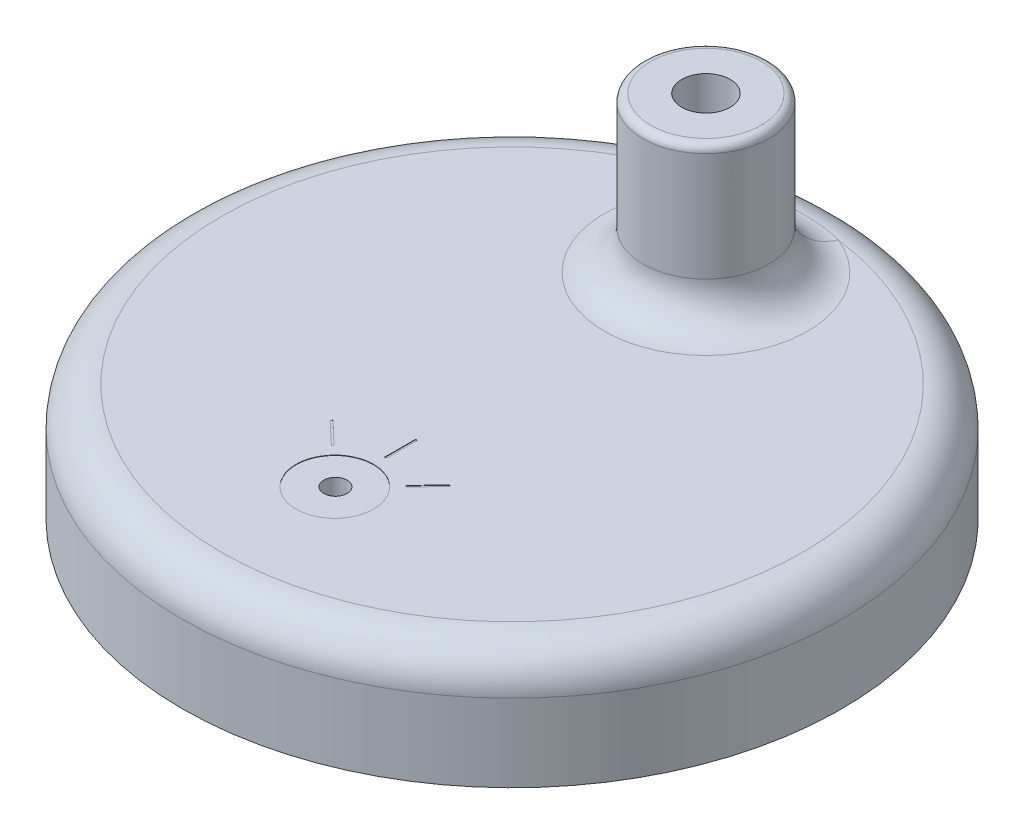
ISO-10303-21;
HEADER;
FILE_DESCRIPTION(('STEP AP214'),'2;1');
FILE_NAME('part.step','',(''),(''),'','','');
FILE_SCHEMA(('AUTOMOTIVE_DESIGN { 1 0 10303 214 1 1 1 1 }'));
ENDSEC;
DATA;
#1=APPLICATION_CONTEXT('core data for automotive mechanical design processes');
#2=APPLICATION_PROTOCOL_DEFINITION('international standard','automotive_design',2000,#1);
#3=PRODUCT_CONTEXT('',#1,'mechanical');
#4=PRODUCT('Part','Part','',(#3));
#5=PRODUCT_RELATED_PRODUCT_CATEGORY('part','',(#4));
#6=PRODUCT_DEFINITION_FORMATION('','',#4);
#7=PRODUCT_DEFINITION_CONTEXT('part definition',#1,'design');
#8=PRODUCT_DEFINITION('design','',#6,#7);
#9=PRODUCT_DEFINITION_SHAPE('','',#8);
#10=(LENGTH_UNIT() NAMED_UNIT(*) SI_UNIT(.MILLI.,.METRE.));
#11=(NAMED_UNIT(*) PLANE_ANGLE_UNIT() SI_UNIT($,.RADIAN.));
#12=(NAMED_UNIT(*) SI_UNIT($,.STERADIAN.) SOLID_ANGLE_UNIT());
#13=UNCERTAINTY_MEASURE_WITH_UNIT(LENGTH_MEASURE(1.E-05),#10,'distance_accuracy_value','');
#14=(GEOMETRIC_REPRESENTATION_CONTEXT(3) GLOBAL_UNCERTAINTY_ASSIGNED_CONTEXT((#13)) GLOBAL_UNIT_ASSIGNED_CONTEXT((#10,
#11,#12)) REPRESENTATION_CONTEXT('',''));
#15=CARTESIAN_POINT('',(0.,0.,0.));
#16=DIRECTION('',(0.,0.,1.));
#17=DIRECTION('',(1.,0.,0.));
#18=AXIS2_PLACEMENT_3D('',#15,#16,#17);
#19=CARTESIAN_POINT('',(0.,5.,0.));
#20=DIRECTION('',(0.,1.,0.));
#21=DIRECTION('',(0.,0.,1.));
#22=AXIS2_PLACEMENT_3D('',#19,#20,#21);
#23=PLANE('',#22);
#24=CARTESIAN_POINT('',(0.,5.,0.));
#25=DIRECTION('',(0.,1.,0.));
#26=DIRECTION('',(0.,0.,1.));
#27=AXIS2_PLACEMENT_3D('',#24,#25,#26);
#28=CIRCLE('',#27,77.);
#29=CARTESIAN_POINT('',(0.,5.,77.));
#30=VERTEX_POINT('',#29);
#31=EDGE_CURVE('E303',#30,#30,#28,.T.);
#32=ORIENTED_EDGE('',*,*,#31,.T.);
#33=EDGE_LOOP('',(#32));
#34=FACE_BOUND('',#33,.T.);
#35=ADVANCED_FACE('F59',(#34),#23,.T.);
#36=CARTESIAN_POINT('',(0.,22.,0.));
#37=DIRECTION('',(0.,1.,0.));
#38=DIRECTION('',(0.,0.,1.));
#39=AXIS2_PLACEMENT_3D('',#36,#37,#38);
#40=PLANE('',#39);
#41=CARTESIAN_POINT('',(0.,22.,-50.));
#42=DIRECTION('',(0.,1.,0.));
#43=DIRECTION('',(0.,0.,1.));
#44=AXIS2_PLACEMENT_3D('',#41,#42,#43);
#45=CIRCLE('',#44,6.25);
#46=CARTESIAN_POINT('',(0.,22.,-43.75));
#47=VERTEX_POINT('',#46);
#48=EDGE_CURVE('E274',#47,#47,#45,.F.);
#49=ORIENTED_EDGE('',*,*,#48,.F.);
#50=EDGE_LOOP('',(#49));
#51=FACE_BOUND('',#50,.T.);
#52=CARTESIAN_POINT('',(0.,22.,0.));
#53=DIRECTION('',(0.,1.,0.));
#54=DIRECTION('',(0.,0.,1.));
#55=AXIS2_PLACEMENT_3D('',#52,#53,#54);
#56=CIRCLE('',#55,75.);
#57=CARTESIAN_POINT('',(0.,22.,75.));
#58=VERTEX_POINT('',#57);
#59=EDGE_CURVE('E283',#58,#58,#56,.T.);
#60=ORIENTED_EDGE('',*,*,#59,.F.);
#61=EDGE_LOOP('',(#60));
#62=FACE_BOUND('',#61,.T.);
#63=ADVANCED_FACE('F363',(#51,#62),#40,.F.);
#64=CARTESIAN_POINT('',(0.,20.,0.));
#65=DIRECTION('',(0.,1.,0.));
#66=DIRECTION('',(0.,0.,1.));
#67=AXIS2_PLACEMENT_3D('',#64,#65,#66);
#68=TOROIDAL_SURFACE('',#67,75.,2.);
#69=CARTESIAN_POINT('',(0.,20.,0.));
#70=DIRECTION('',(0.,-1.,0.));
#71=DIRECTION('',(0.,0.,-1.));
#72=AXIS2_PLACEMENT_3D('',#69,#70,#71);
#73=CIRCLE('',#72,77.);
#74=CARTESIAN_POINT('',(0.,20.,-77.));
#75=VERTEX_POINT('',#74);
#76=EDGE_CURVE('E284',#75,#75,#73,.T.);
#77=ORIENTED_EDGE('',*,*,#76,.T.);
#78=EDGE_LOOP('',(#77));
#79=FACE_BOUND('',#78,.T.);
#80=ORIENTED_EDGE('',*,*,#59,.T.);
#81=EDGE_LOOP('',(#80));
#82=FACE_BOUND('',#81,.T.);
#83=ADVANCED_FACE('F368',(#79,#82),#68,.F.);
#84=CARTESIAN_POINT('',(0.,30.,0.));
#85=DIRECTION('',(0.,-1.,0.));
#86=DIRECTION('',(0.,0.,-1.));
#87=AXIS2_PLACEMENT_3D('',#84,#85,#86);
#88=CYLINDRICAL_SURFACE('',#87,77.);
#89=ORIENTED_EDGE('',*,*,#31,.F.);
#90=EDGE_LOOP('',(#89));
#91=FACE_BOUND('',#90,.T.);
#92=ORIENTED_EDGE('',*,*,#76,.F.);
#93=EDGE_LOOP('',(#92));
#94=FACE_BOUND('',#93,.T.);
#95=ADVANCED_FACE('F372',(#91,#94),#88,.F.);
#96=CARTESIAN_POINT('',(0.,30.,0.));
#97=DIRECTION('',(0.,-1.,0.));
#98=DIRECTION('',(0.,0.,-1.));
#99=AXIS2_PLACEMENT_3D('',#96,#97,#98);
#100=CYLINDRICAL_SURFACE('',#99,85.);
#101=CARTESIAN_POINT('',(0.,20.,0.));
#102=DIRECTION('',(0.,1.,0.));
#103=DIRECTION('',(0.,0.,1.));
#104=AXIS2_PLACEMENT_3D('',#101,#102,#103);
#105=CIRCLE('',#104,85.);
#106=CARTESIAN_POINT('',(0.,20.,85.));
#107=VERTEX_POINT('',#106);
#108=EDGE_CURVE('E299',#107,#107,#105,.F.);
#109=ORIENTED_EDGE('',*,*,#108,.T.);
#110=EDGE_LOOP('',(#109));
#111=FACE_BOUND('',#110,.T.);
#112=CARTESIAN_POINT('',(0.,0.,0.));
#113=DIRECTION('',(0.,1.,0.));
#114=DIRECTION('',(0.,0.,1.));
#115=AXIS2_PLACEMENT_3D('',#112,#113,#114);
#116=CIRCLE('',#115,85.);
#117=CARTESIAN_POINT('',(0.,0.,85.));
#118=VERTEX_POINT('',#117);
#119=EDGE_CURVE('E288',#118,#118,#116,.T.);
#120=ORIENTED_EDGE('',*,*,#119,.T.);
#121=EDGE_LOOP('',(#120));
#122=FACE_BOUND('',#121,.T.);
#123=ADVANCED_FACE('F374',(#111,#122),#100,.T.);
#124=CARTESIAN_POINT('',(0.,30.,0.));
#125=DIRECTION('',(0.,1.,0.));
#126=DIRECTION('',(0.,0.,1.));
#127=AXIS2_PLACEMENT_3D('',#124,#125,#126);
#128=PLANE('',#127);
#129=DIRECTION('',(-0.727050121833967,0.,-0.686584386904635));
#130=VECTOR('',#129,1.);
#131=CARTESIAN_POINT('',(-15.0964064617871,30.,31.1184412613822));
#132=LINE('',#131,#130);
#133=CARTESIAN_POINT('',(-9.2800054871154,30.,36.6111163566193));
#134=VERTEX_POINT('',#133);
#135=CARTESIAN_POINT('',(-15.0964064617871,30.,31.1184412613822));
#136=VERTEX_POINT('',#135);
#137=EDGE_CURVE('E76',#134,#136,#132,.T.);
#138=ORIENTED_EDGE('',*,*,#137,.F.);
#139=DIRECTION('',(0.686584386904637,0.,-0.727050121833966));
#140=VECTOR('',#139,1.);
#141=CARTESIAN_POINT('',(-9.2800054871154,30.,36.6111163566193));
#142=LINE('',#141,#140);
#143=CARTESIAN_POINT('',(-9.62329768056772,30.,36.9746414175363));
#144=VERTEX_POINT('',#143);
#145=EDGE_CURVE('E240',#144,#134,#142,.T.);
#146=ORIENTED_EDGE('',*,*,#145,.F.);
#147=DIRECTION('',(0.727050121833967,0.,0.686584386904635));
#148=VECTOR('',#147,1.);
#149=CARTESIAN_POINT('',(-9.62329768056772,30.,36.9746414175363));
#150=LINE('',#149,#148);
#151=CARTESIAN_POINT('',(-15.4396986552395,30.,31.4819663222992));
#152=VERTEX_POINT('',#151);
#153=EDGE_CURVE('E254',#152,#144,#150,.T.);
#154=ORIENTED_EDGE('',*,*,#153,.F.);
#155=DIRECTION('',(-0.686584386904628,0.,0.727050121833974));
#156=VECTOR('',#155,1.);
#157=CARTESIAN_POINT('',(-15.4396986552395,30.,31.4819663222992));
#158=LINE('',#157,#156);
#159=EDGE_CURVE('E251',#136,#152,#158,.T.);
#160=ORIENTED_EDGE('',*,*,#159,.F.);
#161=EDGE_LOOP('',(#138,#146,#154,#160));
#162=FACE_BOUND('',#161,.T.);
#163=DIRECTION('',(-0.686584386904635,0.,0.727050121833967));
#164=VECTOR('',#163,1.);
#165=CARTESIAN_POINT('',(14.4218951487858,30.,30.4538447339518));
#166=LINE('',#165,#164);
#167=CARTESIAN_POINT('',(14.4218951487858,30.,30.4538447339518));
#168=VERTEX_POINT('',#167);
#169=CARTESIAN_POINT('',(8.9292200535487,30.,36.2702457086236));
#170=VERTEX_POINT('',#169);
#171=EDGE_CURVE('E84',#168,#170,#166,.T.);
#172=ORIENTED_EDGE('',*,*,#171,.F.);
#173=DIRECTION('',(-0.727050121833964,0.,-0.686584386904638));
#174=VECTOR('',#173,1.);
#175=CARTESIAN_POINT('',(14.7854202097028,30.,30.7971369274041));
#176=LINE('',#175,#174);
#177=CARTESIAN_POINT('',(14.7854202097028,30.,30.7971369274041));
#178=VERTEX_POINT('',#177);
#179=EDGE_CURVE('E210',#178,#168,#176,.T.);
#180=ORIENTED_EDGE('',*,*,#179,.F.);
#181=DIRECTION('',(0.686584386904635,0.,-0.727050121833967));
#182=VECTOR('',#181,1.);
#183=CARTESIAN_POINT('',(9.29274511446568,30.,36.6135379020759));
#184=LINE('',#183,#182);
#185=CARTESIAN_POINT('',(9.29274511446568,30.,36.6135379020759));
#186=VERTEX_POINT('',#185);
#187=EDGE_CURVE('E225',#186,#178,#184,.T.);
#188=ORIENTED_EDGE('',*,*,#187,.F.);
#189=DIRECTION('',(0.727050121833966,0.,0.686584386904637));
#190=VECTOR('',#189,1.);
#191=CARTESIAN_POINT('',(8.9292200535487,30.,36.2702457086236));
#192=LINE('',#191,#190);
#193=EDGE_CURVE('E221',#170,#186,#192,.T.);
#194=ORIENTED_EDGE('',*,*,#193,.F.);
#195=EDGE_LOOP('',(#172,#180,#188,#194));
#196=FACE_BOUND('',#195,.T.);
#197=DIRECTION('',(0.,0.,1.));
#198=VECTOR('',#197,1.);
#199=CARTESIAN_POINT('',(-0.169896060632773,30.,24.718475916838));
#200=LINE('',#199,#198);
#201=CARTESIAN_POINT('',(-0.169896060632773,30.,24.718475916838));
#202=VERTEX_POINT('',#201);
#203=CARTESIAN_POINT('',(-0.169896060632772,30.,32.718475916838));
#204=VERTEX_POINT('',#203);
#205=EDGE_CURVE('E169',#202,#204,#200,.T.);
#206=ORIENTED_EDGE('',*,*,#205,.F.);
#207=DIRECTION('',(-1.,0.,0.));
#208=VECTOR('',#207,1.);
#209=CARTESIAN_POINT('',(0.330103939367228,30.,24.718475916838));
#210=LINE('',#209,#208);
#211=CARTESIAN_POINT('',(0.330103939367228,30.,24.718475916838));
#212=VERTEX_POINT('',#211);
#213=EDGE_CURVE('E186',#212,#202,#210,.T.);
#214=ORIENTED_EDGE('',*,*,#213,.F.);
#215=DIRECTION('',(0.,0.,-1.));
#216=VECTOR('',#215,1.);
#217=CARTESIAN_POINT('',(0.330103939367228,30.,32.718475916838));
#218=LINE('',#217,#216);
#219=CARTESIAN_POINT('',(0.330103939367228,30.,32.718475916838));
#220=VERTEX_POINT('',#219);
#221=EDGE_CURVE('E189',#220,#212,#218,.T.);
#222=ORIENTED_EDGE('',*,*,#221,.F.);
#223=DIRECTION('',(1.,0.,0.));
#224=VECTOR('',#223,1.);
#225=CARTESIAN_POINT('',(-0.169896060632772,30.,32.718475916838));
#226=LINE('',#225,#224);
#227=EDGE_CURVE('E195',#204,#220,#226,.T.);
#228=ORIENTED_EDGE('',*,*,#227,.F.);
#229=EDGE_LOOP('',(#206,#214,#222,#228));
#230=FACE_BOUND('',#229,.T.);
#231=CARTESIAN_POINT('',(0.,30.,45.718475916838));
#232=DIRECTION('',(0.,1.,0.));
#233=DIRECTION('',(0.,0.,1.));
#234=AXIS2_PLACEMENT_3D('',#231,#232,#233);
#235=CIRCLE('',#234,10.);
#236=CARTESIAN_POINT('',(0.,30.,55.718475916838));
#237=VERTEX_POINT('',#236);
#238=EDGE_CURVE('E202',#237,#237,#235,.T.);
#239=ORIENTED_EDGE('',*,*,#238,.F.);
#240=EDGE_LOOP('',(#239));
#241=FACE_BOUND('',#240,.T.);
#242=CARTESIAN_POINT('',(0.,30.,0.));
#243=DIRECTION('',(0.,1.,0.));
#244=DIRECTION('',(0.,0.,1.));
#245=AXIS2_PLACEMENT_3D('',#242,#243,#244);
#246=CIRCLE('',#245,75.);
#247=CARTESIAN_POINT('',(-9.78178662665336,30.,-74.359375));
#248=VERTEX_POINT('',#247);
#249=CARTESIAN_POINT('',(9.78178662665336,30.,-74.359375));
#250=VERTEX_POINT('',#249);
#251=EDGE_CURVE('E295',#248,#250,#246,.T.);
#252=ORIENTED_EDGE('',*,*,#251,.T.);
#253=CARTESIAN_POINT('',(0.,30.,-50.));
#254=DIRECTION('',(0.,1.,0.));
#255=DIRECTION('',(0.,0.,1.));
#256=AXIS2_PLACEMENT_3D('',#253,#254,#255);
#257=CIRCLE('',#256,26.25);
#258=EDGE_CURVE('E320',#250,#248,#257,.F.);
#259=ORIENTED_EDGE('',*,*,#258,.T.);
#260=EDGE_LOOP('',(#252,#259));
#261=FACE_BOUND('',#260,.T.);
#262=ADVANCED_FACE('F380',(#162,#196,#230,#241,#261),#128,.T.);
#263=CARTESIAN_POINT('',(0.,0.,0.));
#264=DIRECTION('',(0.,1.,0.));
#265=DIRECTION('',(0.,0.,1.));
#266=AXIS2_PLACEMENT_3D('',#263,#264,#265);
#267=PLANE('',#266);
#268=ORIENTED_EDGE('',*,*,#119,.F.);
#269=EDGE_LOOP('',(#268));
#270=FACE_BOUND('',#269,.T.);
#271=ADVANCED_FACE('F383',(#270),#267,.F.);
#272=CARTESIAN_POINT('',(0.,20.,0.));
#273=DIRECTION('',(0.,1.,0.));
#274=DIRECTION('',(0.,0.,1.));
#275=AXIS2_PLACEMENT_3D('',#272,#273,#274);
#276=TOROIDAL_SURFACE('',#275,75.,10.);
#277=ORIENTED_EDGE('',*,*,#108,.F.);
#278=EDGE_LOOP('',(#277));
#279=FACE_BOUND('',#278,.T.);
#280=ORIENTED_EDGE('',*,*,#251,.F.);
#281=CARTESIAN_POINT('',(10.5892808352099,39.7696777139004,-62.3259738517107));
#282=CARTESIAN_POINT('',(9.9886021369751,28.3430177597039,-62.8420187098177));
#283=CARTESIAN_POINT('',(17.4654145650734,29.8848388569502,-71.3810900013605));
#284=CARTESIAN_POINT('',(10.4211580877375,39.7944853348349,-62.4704101996094));
#285=CARTESIAN_POINT('',(9.86158526746597,28.440254038051,-62.9369728356673));
#286=CARTESIAN_POINT('',(17.1680491111589,29.8972426683596,-71.5372842108471));
#287=CARTESIAN_POINT('',(10.2500144982206,39.8166002484764,-62.6114591233314));
#288=CARTESIAN_POINT('',(9.72918364786473,28.5340887629314,-63.0338780773345));
#289=CARTESIAN_POINT('',(16.8673336116823,29.9083001248585,-71.6898246945153));
#290=CARTESIAN_POINT('',(9.90197769192208,39.8560771535765,-62.8865253218822));
#291=CARTESIAN_POINT('',(9.4547061713332,28.7141812497531,-63.2293112709063));
#292=CARTESIAN_POINT('',(16.2595496195871,29.9280385761398,-71.9873137794136));
#293=CARTESIAN_POINT('',(9.72508478635956,39.8734394018263,-63.020542976301));
#294=CARTESIAN_POINT('',(9.31266120479179,28.800519937613,-63.3278554946196));
#295=CARTESIAN_POINT('',(15.9524814711727,29.9367196993178,-72.1322627904758));
#296=CARTESIAN_POINT('',(9.18642567546236,39.9193294419931,-63.4115174197748));
#297=CARTESIAN_POINT('',(8.87391098920631,29.0474277683155,-63.6226075006375));
#298=CARTESIAN_POINT('',(15.0226226163759,29.9596647184769,-72.5551376061283));
#299=CARTESIAN_POINT('',(8.81645998557508,39.9416910991291,-63.6575839183294));
#300=CARTESIAN_POINT('',(8.56151509470498,29.1981677130123,-63.8202677293131));
#301=CARTESIAN_POINT('',(14.3907904295281,29.9708455489803,-72.8212947627694));
#302=CARTESIAN_POINT('',(8.05733913474006,39.9744653829228,-64.1187531938297));
#303=CARTESIAN_POINT('',(7.90158022411722,29.4715296361413,-64.2056613042062));
#304=CARTESIAN_POINT('',(13.1062053866122,29.987232692046,-73.3201157707678));
#305=CARTESIAN_POINT('',(7.66817445552697,39.9848720192834,-64.333840400828));
#306=CARTESIAN_POINT('',(7.55396358322567,29.5946751616791,-64.3937906175611));
#307=CARTESIAN_POINT('',(12.4534422108957,29.9924360094583,-73.5527627801927));
#308=CARTESIAN_POINT('',(6.87341746592075,39.9976385590885,-64.731467173759));
#309=CARTESIAN_POINT('',(6.8277897650402,29.8153144752179,-64.7515145130012));
#310=CARTESIAN_POINT('',(11.1301663955538,29.998819278999,-73.9828388991872));
#311=CARTESIAN_POINT('',(6.4678215371667,39.9999966802982,-64.913999522379));
#312=CARTESIAN_POINT('',(6.44896810470131,29.9132427754762,-64.92158064195));
#313=CARTESIAN_POINT('',(10.4596498578083,29.9999983400104,-74.1802601993289));
#314=CARTESIAN_POINT('',(5.56427199785282,40.0000039530872,-65.2768250546034));
#315=CARTESIAN_POINT('',(5.59113448684195,30.1023376168339,-65.266025981781));
#316=CARTESIAN_POINT('',(8.97458988734105,30.0000019767088,-74.572664165748));
#317=CARTESIAN_POINT('',(5.06346185789517,39.9966688098448,-65.4500462776576));
#318=CARTESIAN_POINT('',(5.10527472500088,30.1893644260811,-65.4361211757409));
#319=CARTESIAN_POINT('',(8.15697557486438,29.9983344048733,-74.7599948101594));
#320=CARTESIAN_POINT('',(4.04729196626958,39.9878346222389,-65.7468151794958));
#321=CARTESIAN_POINT('',(4.10581077644026,30.3345588946786,-65.7314261869672));
#322=CARTESIAN_POINT('',(6.50618114487869,29.9939173109966,-75.0809207248028));
#323=CARTESIAN_POINT('',(3.53193004739577,39.9823352539613,-65.8703554170522));
#324=CARTESIAN_POINT('',(3.59115645469042,30.3931255296197,-65.8573439947149));
#325=CARTESIAN_POINT('',(5.67299871511673,29.9911676269985,-75.2145079453355));
#326=CARTESIAN_POINT('',(2.49173311588022,39.9724022952317,-66.0665430253609));
#327=CARTESIAN_POINT('',(2.54406305972268,30.4845068126704,-66.0585043677846));
#328=CARTESIAN_POINT('',(3.99660379540629,29.986201147598,-75.4266434416885));
#329=CARTESIAN_POINT('',(1.96690052384671,39.9679684364809,-66.1392032167229));
#330=CARTESIAN_POINT('',(2.01036068094542,30.5175761367642,-66.1342757511084));
#331=CARTESIAN_POINT('',(3.15339388665316,29.9839842180464,-75.5052055825733));
#332=CARTESIAN_POINT('',(0.912684734294976,39.9620820885479,-66.2329760232595));
#333=CARTESIAN_POINT('',(0.93518608682164,30.5599493978722,-66.2320334947921));
#334=CARTESIAN_POINT('',(1.46214948603906,29.9810410440743,-75.6065941690375));
#335=CARTESIAN_POINT('',(0.383301959205837,39.9606293255462,-66.2540933727794));
#336=CARTESIAN_POINT('',(0.392312085277312,30.5693687496259,-66.2542835165303));
#337=CARTESIAN_POINT('',(0.614115444460004,29.980314662744,-75.6294257336168));
#338=CARTESIAN_POINT('',(-0.650778233775684,39.96124169905,-66.2448148930502));
#339=CARTESIAN_POINT('',(-0.666261042870669,30.5652117957447,-66.2445716301269));
#340=CARTESIAN_POINT('',(-1.0426524617699,29.9806208495527,-75.6193938925324));
#341=CARTESIAN_POINT('',(-1.15549790844854,39.963149065443,-66.2167296427287));
#342=CARTESIAN_POINT('',(-1.18335655466072,30.552657500389,-66.2150191120665));
#343=CARTESIAN_POINT('',(-1.85141082533483,29.981574532648,-75.5890286365732));
#344=CARTESIAN_POINT('',(-2.16013153070465,39.9694984398459,-66.1136987711106));
#345=CARTESIAN_POINT('',(-2.20669743340486,30.5059643225316,-66.107773687427));
#346=CARTESIAN_POINT('',(-3.46381225422689,29.9847492198367,-75.4776293480798));
#347=CARTESIAN_POINT('',(-2.66004549913757,39.9739404368543,-66.0387533532112));
#348=CARTESIAN_POINT('',(-2.71415008318575,30.471711719513,-66.0298233979263));
#349=CARTESIAN_POINT('',(-4.26745534174164,29.9869702184294,-75.3965955354733));
#350=CARTESIAN_POINT('',(-3.65070950947554,39.9835634697533,-65.8426577074798));
#351=CARTESIAN_POINT('',(-3.70969036604063,30.3800265906688,-65.8291939751761));
#352=CARTESIAN_POINT('',(-5.86496329822207,29.9917817348745,-75.1845577226091));
#353=CARTESIAN_POINT('',(-4.14145968359005,39.9887444949723,-65.721508146793));
#354=CARTESIAN_POINT('',(-4.19886516470898,30.3223672331113,-65.7060489053849));
#355=CARTESIAN_POINT('',(-6.65882830820335,29.9943722473911,-75.0535544438646));
#356=CARTESIAN_POINT('',(-5.1095380474594,39.9969639871098,-65.4340538123098));
#357=CARTESIAN_POINT('',(-5.14976671165493,30.181357542519,-65.4205107392177));
#358=CARTESIAN_POINT('',(-8.23220956670001,29.9984819935525,-74.7426997114601));
#359=CARTESIAN_POINT('',(-5.58686733910364,40.0000026304194,-65.2677527575858));
#360=CARTESIAN_POINT('',(-5.61239235809538,30.0976527581988,-65.2574948252393));
#361=CARTESIAN_POINT('',(-9.01172699136383,30.0000013153929,-74.5628522810316));
#362=CARTESIAN_POINT('',(-6.46769357502888,39.9999976852287,-64.9140500327656));
#363=CARTESIAN_POINT('',(-6.44884309246948,29.9132693750597,-64.9216268397239));
#364=CARTESIAN_POINT('',(-10.459439758981,29.9999988424532,-74.1803148200741));
#365=CARTESIAN_POINT('',(-6.87317689374355,39.9976402035407,-64.7315751199425));
#366=CARTESIAN_POINT('',(-6.82756333866053,29.815372669955,-64.7516150156731));
#367=CARTESIAN_POINT('',(-11.129768765096,29.9988201011625,-73.9829556485599));
#368=CARTESIAN_POINT('',(-7.66773014937943,39.9848813754319,-64.3340750941808));
#369=CARTESIAN_POINT('',(-7.55356211273921,29.5948078423041,-64.3939995263515));
#370=CARTESIAN_POINT('',(-12.4526995175216,29.9924406875043,-73.5530166322736));
#371=CARTESIAN_POINT('',(-8.05680299827093,39.9744814624936,-64.1190557874461));
#372=CARTESIAN_POINT('',(-7.90110335569886,29.4717045692311,-64.205923996524));
#373=CARTESIAN_POINT('',(-13.105304401524,29.9872407318779,-73.3204430700534));
#374=CARTESIAN_POINT('',(-8.81595946082969,39.9417197642112,-63.6579110554723));
#375=CARTESIAN_POINT('',(-8.56109085046999,29.1983662585109,-63.8205314376144));
#376=CARTESIAN_POINT('',(-14.3899371888429,29.9708598814745,-72.8216486077874));
#377=CARTESIAN_POINT('',(-9.18604225792847,39.9193574649585,-63.411784294192));
#378=CARTESIAN_POINT('',(-8.87359367568541,29.0475935362568,-63.62281438197));
#379=CARTESIAN_POINT('',(-15.0219642068888,29.9596787297432,-72.5554262625525));
#380=CARTESIAN_POINT('',(-9.72486040969173,39.8734608352862,-63.0207115470778));
#381=CARTESIAN_POINT('',(-9.3124806539977,28.8006280207715,-63.3279799780949));
#382=CARTESIAN_POINT('',(-15.9520924089999,29.9367304159106,-72.1324451117974));
#383=CARTESIAN_POINT('',(-9.90180027245325,39.8560959115145,-62.8866626298353));
#384=CARTESIAN_POINT('',(-9.45456522794619,28.7142702620476,-63.2294103336201));
#385=CARTESIAN_POINT('',(-16.2592407170763,29.9280479550537,-71.9874622837401));
#386=CARTESIAN_POINT('',(-10.2499280000546,39.8166114231398,-62.6115303969441));
#387=CARTESIAN_POINT('',(-9.72911697095465,28.5341360060561,-63.033926856606));
#388=CARTESIAN_POINT('',(-16.8671816297355,29.9083057122449,-71.6899017750215));
#389=CARTESIAN_POINT('',(-10.4211155587688,39.7944916059532,-62.4704467079088));
#390=CARTESIAN_POINT('',(-9.86155323903102,28.4402785285155,-62.9369967339161));
#391=CARTESIAN_POINT('',(-17.1679738957479,29.8972458040011,-71.5373236912255));
#392=CARTESIAN_POINT('',(-10.5892808352099,39.7696777139004,-62.3259738517107));
#393=CARTESIAN_POINT('',(-9.98860213697511,28.3430177597039,-62.8420187098177));
#394=CARTESIAN_POINT('',(-17.4654145650734,29.8848388569502,-71.3810900013604));
#395=(BOUNDED_SURFACE() B_SPLINE_SURFACE(3,2,((#281,#282,#283),(#284,#285,#286),(#287,#288,
#289),(#290,#291,#292),(#293,#294,#295),(#296,#297,#298),(#299,#300,#301),(#302,#303,#304),
(#305,#306,#307),(#308,#309,#310),(#311,#312,#313),(#314,#315,#316),(#317,#318,#319),(#320,#321,
#322),(#323,#324,#325),(#326,#327,#328),(#329,#330,#331),(#332,#333,#334),(#335,#336,#337),
(#338,#339,#340),(#341,#342,#343),(#344,#345,#346),(#347,#348,#349),(#350,#351,#352),(#353,#354,
#355),(#356,#357,#358),(#359,#360,#361),(#362,#363,#364),(#365,#366,#367),(#368,#369,#370),
(#371,#372,#373),(#374,#375,#376),(#377,#378,#379),(#380,#381,#382),(#383,#384,#385),(#386,#387,
#388),(#389,#390,#391),(#392,#393,#394)),.UNSPECIFIED.,.F.,.F.,
.F.) B_SPLINE_SURFACE_WITH_KNOTS((4,2,2,2,2,2,2,2,2,2,2,2,2,2,2,2,2,2,4),(3,3),(0.,
1.07652589818409,2.15299361915025,4.30453091176525,6.45714580468083,8.61023733413072,
11.1741298453853,13.7384062340593,16.3020362509166,18.8654307827662,21.311650782306,
23.7578601640707,26.204034226159,28.6500068610301,30.8024648547347,32.9545392828233,
35.1067061722739,36.1834467469312,37.2602445329957),(0.,1.),
.UNSPECIFIED.) GEOMETRIC_REPRESENTATION_ITEM() RATIONAL_B_SPLINE_SURFACE(((1.,0.657673203835904,
1.),(1.,0.660180589968664,1.),(1.,0.662645040851511,1.),(1.,0.667477348452048,1.),(1.,
0.669845210382648,1.),(1.,0.676785223437298,1.),(1.,0.681197085734754,1.),(1.,0.689520685332682,
1.),(1.,0.693432171038161,1.),(1.,0.700698276543464,1.),(1.,0.70405277284909,1.),(1.,
0.710743481716281,1.),(1.,0.713954091865075,1.),(1.,0.719468334504517,1.),(1.,0.721771831126451,
1.),(1.,0.72543477550373,1.),(1.,0.72679446107715,1.),(1.,0.728549861399695,1.),(1.,
0.72894566468393,1.),(1.,0.728771856792744,1.),(1.,0.728245548360262,1.),(1.,0.72631730912763,
1.),(1.,0.724915382128113,1.),(1.,0.721255423161064,1.),(1.,0.718997403554723,1.),(1.,
0.713657754643879,1.),(1.,0.710576193173821,1.),(1.,0.704053695694503,1.),(1.,0.700700258182836,
1.),(1.,0.693436450670378,1.),(1.,0.689526180020825,1.),(1.,0.681202956978801,1.),(1.,
0.676789982996413,1.),(1.,0.669848191465044,1.),(1.,0.667479767472152,1.),(1.,0.662646286191779,
1.),(1.,0.660181223776482,1.),(1.,0.657673203835905,1.))) REPRESENTATION_ITEM('') SURFACE());
#396=CARTESIAN_POINT('',(-17.4654145650734,29.8848388569502,-71.3810900013604));
#397=CARTESIAN_POINT('',(-17.1679738957479,29.8972458040011,-71.5373236912255));
#398=CARTESIAN_POINT('',(-16.8671816297355,29.9083057122449,-71.6899017750215));
#399=CARTESIAN_POINT('',(-16.2592407170763,29.9280479550537,-71.9874622837401));
#400=CARTESIAN_POINT('',(-15.9520924089999,29.9367304159106,-72.1324451117974));
#401=CARTESIAN_POINT('',(-15.0219642068888,29.9596787297432,-72.5554262625525));
#402=CARTESIAN_POINT('',(-14.3899371888429,29.9708598814745,-72.8216486077874));
#403=CARTESIAN_POINT('',(-13.105304401524,29.9872407318779,-73.3204430700534));
#404=CARTESIAN_POINT('',(-12.4526995175216,29.9924406875043,-73.5530166322736));
#405=CARTESIAN_POINT('',(-11.129768765096,29.9988201011625,-73.9829556485599));
#406=CARTESIAN_POINT('',(-10.459439758981,29.9999988424532,-74.1803148200742));
#407=CARTESIAN_POINT('',(-9.01172699136383,30.0000013153929,-74.5628522810316));
#408=CARTESIAN_POINT('',(-8.23220956670001,29.9984819935525,-74.7426997114601));
#409=CARTESIAN_POINT('',(-6.65882830820335,29.9943722473911,-75.0535544438646));
#410=CARTESIAN_POINT('',(-5.86496329822206,29.9917817348745,-75.1845577226091));
#411=CARTESIAN_POINT('',(-4.26745534174164,29.9869702184294,-75.3965955354733));
#412=CARTESIAN_POINT('',(-3.46381225422689,29.9847492198367,-75.4776293480798));
#413=CARTESIAN_POINT('',(-1.85141082533483,29.981574532648,-75.5890286365732));
#414=CARTESIAN_POINT('',(-1.0426524617699,29.9806208495527,-75.6193938925324));
#415=CARTESIAN_POINT('',(0.614115444460003,29.980314662744,-75.6294257336168));
#416=CARTESIAN_POINT('',(1.46214948603906,29.9810410440743,-75.6065941690375));
#417=CARTESIAN_POINT('',(3.15339388665316,29.9839842180464,-75.5052055825733));
#418=CARTESIAN_POINT('',(3.99660379540629,29.986201147598,-75.4266434416885));
#419=CARTESIAN_POINT('',(5.67299871511673,29.9911676269985,-75.2145079453355));
#420=CARTESIAN_POINT('',(6.50618114487869,29.9939173109966,-75.0809207248028));
#421=CARTESIAN_POINT('',(8.15697557486438,29.9983344048733,-74.7599948101594));
#422=CARTESIAN_POINT('',(8.97458988734105,30.0000019767088,-74.572664165748));
#423=CARTESIAN_POINT('',(10.4596498578083,29.9999983400104,-74.1802601993289));
#424=CARTESIAN_POINT('',(11.1301663955538,29.998819278999,-73.9828388991872));
#425=CARTESIAN_POINT('',(12.4534422108957,29.9924360094583,-73.5527627801927));
#426=CARTESIAN_POINT('',(13.1062053866122,29.987232692046,-73.3201157707678));
#427=CARTESIAN_POINT('',(14.3907904295281,29.9708455489803,-72.8212947627694));
#428=CARTESIAN_POINT('',(15.0226226163759,29.9596647184769,-72.5551376061283));
#429=CARTESIAN_POINT('',(15.9524814711727,29.9367196993178,-72.1322627904758));
#430=CARTESIAN_POINT('',(16.2595496195871,29.9280385761398,-71.9873137794136));
#431=CARTESIAN_POINT('',(16.8673336116823,29.9083001248585,-71.6898246945153));
#432=CARTESIAN_POINT('',(17.1680491111589,29.8972426683596,-71.5372842108471));
#433=CARTESIAN_POINT('',(17.4654145650734,29.8848388569502,-71.3810900013605));
#434=B_SPLINE_CURVE_WITH_KNOTS('',3,(#396,#397,#398,#399,#400,#401,#402,#403,#404,#405,#406,
#407,#408,#409,#410,#411,#412,#413,#414,#415,#416,#417,#418,#419,#420,#421,#422,#423,#424,#425,
#426,#427,#428,#429,#430,#431,#432,#433),.UNSPECIFIED.,.F.,.F.,(4,2,2,2,2,2,2,2,2,2,2,2,2,2,2,2,
2,2,4),(0.,1.07679778606445,2.15353836072181,4.30570525017241,6.45777967826098,8.61023767196558,
11.0562103068367,13.502384368925,15.9485937506897,18.3948137502295,20.9582082820791,
23.5218382989363,26.0861146876104,28.650007198865,30.8030987283149,32.9557136212304,
35.1072509138454,36.1837186348116,37.2602445329957),.UNSPECIFIED.);
#435=EDGE_CURVE('E401',#248,#250,#434,.T.);
#436=ORIENTED_EDGE('',*,*,#435,.T.);
#437=EDGE_LOOP('',(#280,#436));
#438=FACE_BOUND('',#437,.T.);
#439=ADVANCED_FACE('F330',(#279,#438),#276,.T.);
#440=CARTESIAN_POINT('',(0.,70.,-50.));
#441=DIRECTION('',(0.,1.,0.));
#442=DIRECTION('',(0.,0.,1.));
#443=AXIS2_PLACEMENT_3D('',#440,#441,#442);
#444=PLANE('',#443);
#445=CARTESIAN_POINT('',(0.,70.,-50.));
#446=DIRECTION('',(0.,1.,0.));
#447=DIRECTION('',(0.,0.,1.));
#448=AXIS2_PLACEMENT_3D('',#445,#446,#447);
#449=CIRCLE('',#448,14.25);
#450=CARTESIAN_POINT('',(0.,70.,-35.75));
#451=VERTEX_POINT('',#450);
#452=EDGE_CURVE('E69',#451,#451,#449,.T.);
#453=ORIENTED_EDGE('',*,*,#452,.T.);
#454=EDGE_LOOP('',(#453));
#455=FACE_BOUND('',#454,.T.);
#456=CARTESIAN_POINT('',(0.,70.,-50.));
#457=DIRECTION('',(0.,1.,0.));
#458=DIRECTION('',(0.,0.,1.));
#459=AXIS2_PLACEMENT_3D('',#456,#457,#458);
#460=CIRCLE('',#459,6.25);
#461=CARTESIAN_POINT('',(0.,70.,-43.75));
#462=VERTEX_POINT('',#461);
#463=EDGE_CURVE('E278',#462,#462,#460,.T.);
#464=ORIENTED_EDGE('',*,*,#463,.F.);
#465=EDGE_LOOP('',(#464));
#466=FACE_BOUND('',#465,.T.);
#467=ADVANCED_FACE('F397',(#455,#466),#444,.T.);
#468=CARTESIAN_POINT('',(0.,70.,-50.));
#469=DIRECTION('',(0.,-1.,0.));
#470=DIRECTION('',(0.,0.,-1.));
#471=AXIS2_PLACEMENT_3D('',#468,#469,#470);
#472=CYLINDRICAL_SURFACE('',#471,16.25);
#473=CARTESIAN_POINT('',(0.,68.,-50.));
#474=DIRECTION('',(0.,1.,0.));
#475=DIRECTION('',(0.,0.,1.));
#476=AXIS2_PLACEMENT_3D('',#473,#474,#475);
#477=CIRCLE('',#476,16.25);
#478=CARTESIAN_POINT('',(0.,68.,-33.75));
#479=VERTEX_POINT('',#478);
#480=EDGE_CURVE('E13',#479,#479,#477,.F.);
#481=ORIENTED_EDGE('',*,*,#480,.T.);
#482=EDGE_LOOP('',(#481));
#483=FACE_BOUND('',#482,.T.);
#484=CARTESIAN_POINT('',(0.,40.,-50.));
#485=DIRECTION('',(0.,1.,0.));
#486=DIRECTION('',(0.,0.,1.));
#487=AXIS2_PLACEMENT_3D('',#484,#485,#486);
#488=CIRCLE('',#487,16.25);
#489=CARTESIAN_POINT('',(-6.0553917212616,40.,-65.0796130952381));
#490=VERTEX_POINT('',#489);
#491=CARTESIAN_POINT('',(6.0553917212616,40.,-65.0796130952381));
#492=VERTEX_POINT('',#491);
#493=EDGE_CURVE('E307',#490,#492,#488,.T.);
#494=ORIENTED_EDGE('',*,*,#493,.T.);
#495=CARTESIAN_POINT('',(10.5892808352099,39.7696777139004,-62.3259738517107));
#496=CARTESIAN_POINT('',(10.4211580877375,39.7944853348349,-62.4704101996094));
#497=CARTESIAN_POINT('',(10.2500144982206,39.8166002484764,-62.6114591233314));
#498=CARTESIAN_POINT('',(9.90197769192208,39.8560771535765,-62.8865253218822));
#499=CARTESIAN_POINT('',(9.72508478635956,39.8734394018263,-63.020542976301));
#500=CARTESIAN_POINT('',(9.18642567546235,39.9193294419931,-63.4115174197748));
#501=CARTESIAN_POINT('',(8.81645998557508,39.9416910991291,-63.6575839183294));
#502=CARTESIAN_POINT('',(8.05733913474006,39.9744653829228,-64.1187531938297));
#503=CARTESIAN_POINT('',(7.66817445552697,39.9848720192834,-64.333840400828));
#504=CARTESIAN_POINT('',(6.87341746592075,39.9976385590885,-64.731467173759));
#505=CARTESIAN_POINT('',(6.4678215371667,39.9999966802982,-64.913999522379));
#506=CARTESIAN_POINT('',(5.56427199785283,40.0000039530872,-65.2768250546034));
#507=CARTESIAN_POINT('',(5.06346185789517,39.9966688098448,-65.4500462776576));
#508=CARTESIAN_POINT('',(4.04729196626958,39.9878346222389,-65.7468151794958));
#509=CARTESIAN_POINT('',(3.53193004739577,39.9823352539612,-65.8703554170522));
#510=CARTESIAN_POINT('',(2.49173311588022,39.9724022952317,-66.0665430253609));
#511=CARTESIAN_POINT('',(1.96690052384671,39.9679684364809,-66.1392032167229));
#512=CARTESIAN_POINT('',(0.912684734294977,39.9620820885479,-66.2329760232595));
#513=CARTESIAN_POINT('',(0.383301959205836,39.9606293255462,-66.2540933727794));
#514=CARTESIAN_POINT('',(-0.650778233775685,39.96124169905,-66.2448148930502));
#515=CARTESIAN_POINT('',(-1.15549790844855,39.963149065443,-66.2167296427287));
#516=CARTESIAN_POINT('',(-2.16013153070465,39.9694984398459,-66.1136987711106));
#517=CARTESIAN_POINT('',(-2.66004549913757,39.9739404368543,-66.0387533532112));
#518=CARTESIAN_POINT('',(-3.65070950947554,39.9835634697533,-65.8426577074798));
#519=CARTESIAN_POINT('',(-4.14145968359005,39.9887444949723,-65.721508146793));
#520=CARTESIAN_POINT('',(-5.1095380474594,39.9969639871098,-65.4340538123099));
#521=CARTESIAN_POINT('',(-5.58686733910364,40.0000026304194,-65.2677527575858));
#522=CARTESIAN_POINT('',(-6.46769357502888,39.9999976852287,-64.9140500327656));
#523=CARTESIAN_POINT('',(-6.87317689374355,39.9976402035407,-64.7315751199425));
#524=CARTESIAN_POINT('',(-7.66773014937943,39.9848813754319,-64.3340750941808));
#525=CARTESIAN_POINT('',(-8.05680299827093,39.9744814624936,-64.1190557874461));
#526=CARTESIAN_POINT('',(-8.81595946082969,39.9417197642112,-63.6579110554723));
#527=CARTESIAN_POINT('',(-9.18604225792847,39.9193574649585,-63.411784294192));
#528=CARTESIAN_POINT('',(-9.72486040969173,39.8734608352862,-63.0207115470778));
#529=CARTESIAN_POINT('',(-9.90180027245325,39.8560959115145,-62.8866626298353));
#530=CARTESIAN_POINT('',(-10.2499280000546,39.8166114231398,-62.6115303969441));
#531=CARTESIAN_POINT('',(-10.4211155587688,39.7944916059532,-62.4704467079088));
#532=CARTESIAN_POINT('',(-10.5892808352099,39.7696777139004,-62.3259738517107));
#533=B_SPLINE_CURVE_WITH_KNOTS('',3,(#495,#496,#497,#498,#499,#500,#501,#502,#503,#504,#505,
#506,#507,#508,#509,#510,#511,#512,#513,#514,#515,#516,#517,#518,#519,#520,#521,#522,#523,#524,
#525,#526,#527,#528,#529,#530,#531,#532),.UNSPECIFIED.,.F.,.F.,(4,2,2,2,2,2,2,2,2,2,2,2,2,2,2,2,
2,2,4),(0.,1.07652589818409,2.15299361915025,4.30453091176525,6.45714580468083,8.61023733413072,
11.1741298453853,13.7384062340593,16.3020362509166,18.8654307827662,21.311650782306,
23.7578601640707,26.204034226159,28.6500068610301,30.8024648547347,32.9545392828233,
35.1067061722739,36.1834467469312,37.2602445329957),.UNSPECIFIED.);
#534=EDGE_CURVE('E310',#492,#490,#533,.T.);
#535=ORIENTED_EDGE('',*,*,#534,.T.);
#536=EDGE_LOOP('',(#494,#535));
#537=FACE_BOUND('',#536,.T.);
#538=ADVANCED_FACE('F322',(#483,#537),#472,.T.);
#539=CARTESIAN_POINT('',(0.,70.,-50.));
#540=DIRECTION('',(0.,-1.,0.));
#541=DIRECTION('',(0.,0.,-1.));
#542=AXIS2_PLACEMENT_3D('',#539,#540,#541);
#543=CYLINDRICAL_SURFACE('',#542,6.25);
#544=ORIENTED_EDGE('',*,*,#463,.T.);
#545=EDGE_LOOP('',(#544));
#546=FACE_BOUND('',#545,.T.);
#547=ORIENTED_EDGE('',*,*,#48,.T.);
#548=EDGE_LOOP('',(#547));
#549=FACE_BOUND('',#548,.T.);
#550=ADVANCED_FACE('F354',(#546,#549),#543,.F.);
#551=CARTESIAN_POINT('',(0.,40.,-50.));
#552=DIRECTION('',(0.,1.,0.));
#553=DIRECTION('',(0.,0.,1.));
#554=AXIS2_PLACEMENT_3D('',#551,#552,#553);
#555=TOROIDAL_SURFACE('',#554,26.25,10.);
#556=CARTESIAN_POINT('',(-9.78178662665336,40.,-74.359375));
#557=DIRECTION('',(-0.927976190476191,0.,0.372639490539175));
#558=DIRECTION('',(0.372639490539175,0.,0.927976190476191));
#559=AXIS2_PLACEMENT_3D('',#556,#557,#558);
#560=CIRCLE('',#559,10.);
#561=EDGE_CURVE('E273',#248,#490,#560,.T.);
#562=ORIENTED_EDGE('',*,*,#561,.F.);
#563=ORIENTED_EDGE('',*,*,#258,.F.);
#564=CARTESIAN_POINT('',(9.78178662665336,40.,-74.359375));
#565=DIRECTION('',(0.927976190476191,0.,0.372639490539175));
#566=DIRECTION('',(0.372639490539175,0.,-0.927976190476191));
#567=AXIS2_PLACEMENT_3D('',#564,#565,#566);
#568=CIRCLE('',#567,10.);
#569=EDGE_CURVE('E279',#492,#250,#568,.T.);
#570=ORIENTED_EDGE('',*,*,#569,.F.);
#571=ORIENTED_EDGE('',*,*,#493,.F.);
#572=EDGE_LOOP('',(#562,#563,#570,#571));
#573=FACE_BOUND('',#572,.T.);
#574=ADVANCED_FACE('F339',(#573),#555,.F.);
#575=ORIENTED_EDGE('',*,*,#569,.T.);
#576=ORIENTED_EDGE('',*,*,#435,.F.);
#577=ORIENTED_EDGE('',*,*,#561,.T.);
#578=ORIENTED_EDGE('',*,*,#534,.F.);
#579=EDGE_LOOP('',(#575,#576,#577,#578));
#580=FACE_BOUND('',#579,.T.);
#581=ADVANCED_FACE('F334',(#580),#395,.F.);
#582=CARTESIAN_POINT('',(0.,68.,-50.));
#583=DIRECTION('',(0.,1.,0.));
#584=DIRECTION('',(0.,0.,1.));
#585=AXIS2_PLACEMENT_3D('',#582,#583,#584);
#586=TOROIDAL_SURFACE('',#585,14.25,2.);
#587=ORIENTED_EDGE('',*,*,#480,.F.);
#588=EDGE_LOOP('',(#587));
#589=FACE_BOUND('',#588,.T.);
#590=ORIENTED_EDGE('',*,*,#452,.F.);
#591=EDGE_LOOP('',(#590));
#592=FACE_BOUND('',#591,.T.);
#593=ADVANCED_FACE('F61',(#589,#592),#586,.T.);
#594=CARTESIAN_POINT('',(0.,29.9,45.718475916838));
#595=DIRECTION('',(0.,1.,0.));
#596=DIRECTION('',(0.,0.,1.));
#597=AXIS2_PLACEMENT_3D('',#594,#595,#596);
#598=PLANE('',#597);
#599=CARTESIAN_POINT('',(0.,29.9,45.718475916838));
#600=DIRECTION('',(0.,1.,0.));
#601=DIRECTION('',(0.,0.,1.));
#602=AXIS2_PLACEMENT_3D('',#599,#600,#601);
#603=CIRCLE('',#602,10.);
#604=CARTESIAN_POINT('',(0.,29.9,55.718475916838));
#605=VERTEX_POINT('',#604);
#606=EDGE_CURVE('E265',#605,#605,#603,.T.);
#607=ORIENTED_EDGE('',*,*,#606,.T.);
#608=EDGE_LOOP('',(#607));
#609=FACE_BOUND('',#608,.T.);
#610=CARTESIAN_POINT('',(0.,29.9,45.5544485459943));
#611=DIRECTION('',(0.,1.,0.));
#612=DIRECTION('',(0.,0.,1.));
#613=AXIS2_PLACEMENT_3D('',#610,#611,#612);
#614=CIRCLE('',#613,3.);
#615=CARTESIAN_POINT('',(0.,29.9,48.5544485459943));
#616=VERTEX_POINT('',#615);
#617=EDGE_CURVE('E63',#616,#616,#614,.F.);
#618=ORIENTED_EDGE('',*,*,#617,.T.);
#619=EDGE_LOOP('',(#618));
#620=FACE_BOUND('',#619,.T.);
#621=ADVANCED_FACE('F438',(#609,#620),#598,.T.);
#622=CARTESIAN_POINT('',(0.,29.9,45.718475916838));
#623=DIRECTION('',(0.,1.,0.));
#624=DIRECTION('',(0.,0.,1.));
#625=AXIS2_PLACEMENT_3D('',#622,#623,#624);
#626=CYLINDRICAL_SURFACE('',#625,10.);
#627=ORIENTED_EDGE('',*,*,#606,.F.);
#628=EDGE_LOOP('',(#627));
#629=FACE_BOUND('',#628,.T.);
#630=ORIENTED_EDGE('',*,*,#238,.T.);
#631=EDGE_LOOP('',(#630));
#632=FACE_BOUND('',#631,.T.);
#633=ADVANCED_FACE('F443',(#629,#632),#626,.F.);
#634=CARTESIAN_POINT('',(-0.169896060632773,29.9,24.718475916838));
#635=DIRECTION('',(-1.,0.,0.));
#636=DIRECTION('',(0.,0.,1.));
#637=AXIS2_PLACEMENT_3D('',#634,#635,#636);
#638=PLANE('',#637);
#639=ORIENTED_EDGE('',*,*,#205,.T.);
#640=DIRECTION('',(0.,1.,0.));
#641=VECTOR('',#640,1.);
#642=CARTESIAN_POINT('',(-0.169896060632772,29.9,32.718475916838));
#643=LINE('',#642,#641);
#644=CARTESIAN_POINT('',(-0.169896060632772,29.9,32.718475916838));
#645=VERTEX_POINT('',#644);
#646=EDGE_CURVE('E162',#645,#204,#643,.T.);
#647=ORIENTED_EDGE('',*,*,#646,.F.);
#648=DIRECTION('',(0.,0.,1.));
#649=VECTOR('',#648,1.);
#650=CARTESIAN_POINT('',(-0.169896060632773,29.9,24.718475916838));
#651=LINE('',#650,#649);
#652=CARTESIAN_POINT('',(-0.169896060632773,29.9,24.718475916838));
#653=VERTEX_POINT('',#652);
#654=EDGE_CURVE('E166',#653,#645,#651,.T.);
#655=ORIENTED_EDGE('',*,*,#654,.F.);
#656=DIRECTION('',(0.,1.,0.));
#657=VECTOR('',#656,1.);
#658=CARTESIAN_POINT('',(-0.169896060632773,29.9,24.718475916838));
#659=LINE('',#658,#657);
#660=EDGE_CURVE('E200',#653,#202,#659,.T.);
#661=ORIENTED_EDGE('',*,*,#660,.T.);
#662=EDGE_LOOP('',(#639,#647,#655,#661));
#663=FACE_BOUND('',#662,.T.);
#664=ADVANCED_FACE('F164',(#663),#638,.F.);
#665=CARTESIAN_POINT('',(0.330103939367228,29.9,24.718475916838));
#666=DIRECTION('',(0.,0.,-1.));
#667=DIRECTION('',(-1.,0.,0.));
#668=AXIS2_PLACEMENT_3D('',#665,#666,#667);
#669=PLANE('',#668);
#670=ORIENTED_EDGE('',*,*,#213,.T.);
#671=ORIENTED_EDGE('',*,*,#660,.F.);
#672=DIRECTION('',(-1.,0.,0.));
#673=VECTOR('',#672,1.);
#674=CARTESIAN_POINT('',(0.330103939367228,29.9,24.718475916838));
#675=LINE('',#674,#673);
#676=CARTESIAN_POINT('',(0.330103939367228,29.9,24.718475916838));
#677=VERTEX_POINT('',#676);
#678=EDGE_CURVE('E174',#677,#653,#675,.T.);
#679=ORIENTED_EDGE('',*,*,#678,.F.);
#680=DIRECTION('',(0.,1.,0.));
#681=VECTOR('',#680,1.);
#682=CARTESIAN_POINT('',(0.330103939367228,29.9,24.718475916838));
#683=LINE('',#682,#681);
#684=EDGE_CURVE('E203',#677,#212,#683,.T.);
#685=ORIENTED_EDGE('',*,*,#684,.T.);
#686=EDGE_LOOP('',(#670,#671,#679,#685));
#687=FACE_BOUND('',#686,.T.);
#688=ADVANCED_FACE('F507',(#687),#669,.F.);
#689=CARTESIAN_POINT('',(0.330103939367228,29.9,32.718475916838));
#690=DIRECTION('',(1.,0.,0.));
#691=DIRECTION('',(0.,0.,-1.));
#692=AXIS2_PLACEMENT_3D('',#689,#690,#691);
#693=PLANE('',#692);
#694=ORIENTED_EDGE('',*,*,#221,.T.);
#695=ORIENTED_EDGE('',*,*,#684,.F.);
#696=DIRECTION('',(0.,0.,-1.));
#697=VECTOR('',#696,1.);
#698=CARTESIAN_POINT('',(0.330103939367228,29.9,32.718475916838));
#699=LINE('',#698,#697);
#700=CARTESIAN_POINT('',(0.330103939367228,29.9,32.718475916838));
#701=VERTEX_POINT('',#700);
#702=EDGE_CURVE('E182',#701,#677,#699,.T.);
#703=ORIENTED_EDGE('',*,*,#702,.F.);
#704=DIRECTION('',(0.,1.,0.));
#705=VECTOR('',#704,1.);
#706=CARTESIAN_POINT('',(0.330103939367228,29.9,32.718475916838));
#707=LINE('',#706,#705);
#708=EDGE_CURVE('E173',#701,#220,#707,.T.);
#709=ORIENTED_EDGE('',*,*,#708,.T.);
#710=EDGE_LOOP('',(#694,#695,#703,#709));
#711=FACE_BOUND('',#710,.T.);
#712=ADVANCED_FACE('F510',(#711),#693,.F.);
#713=CARTESIAN_POINT('',(-0.169896060632772,29.9,32.718475916838));
#714=DIRECTION('',(0.,0.,1.));
#715=DIRECTION('',(1.,0.,0.));
#716=AXIS2_PLACEMENT_3D('',#713,#714,#715);
#717=PLANE('',#716);
#718=ORIENTED_EDGE('',*,*,#227,.T.);
#719=ORIENTED_EDGE('',*,*,#708,.F.);
#720=DIRECTION('',(1.,0.,0.));
#721=VECTOR('',#720,1.);
#722=CARTESIAN_POINT('',(-0.169896060632772,29.9,32.718475916838));
#723=LINE('',#722,#721);
#724=EDGE_CURVE('E177',#645,#701,#723,.T.);
#725=ORIENTED_EDGE('',*,*,#724,.F.);
#726=ORIENTED_EDGE('',*,*,#646,.T.);
#727=EDGE_LOOP('',(#718,#719,#725,#726));
#728=FACE_BOUND('',#727,.T.);
#729=ADVANCED_FACE('F178',(#728),#717,.F.);
#730=CARTESIAN_POINT('',(0.,29.9,0.));
#731=DIRECTION('',(0.,1.,0.));
#732=DIRECTION('',(0.,0.,1.));
#733=AXIS2_PLACEMENT_3D('',#730,#731,#732);
#734=PLANE('',#733);
#735=ORIENTED_EDGE('',*,*,#654,.T.);
#736=ORIENTED_EDGE('',*,*,#724,.T.);
#737=ORIENTED_EDGE('',*,*,#702,.T.);
#738=ORIENTED_EDGE('',*,*,#678,.T.);
#739=EDGE_LOOP('',(#735,#736,#737,#738));
#740=FACE_BOUND('',#739,.T.);
#741=ADVANCED_FACE('F184',(#740),#734,.T.);
#742=CARTESIAN_POINT('',(14.4218951487858,29.9,30.4538447339518));
#743=DIRECTION('',(-0.727050121833967,0.,-0.686584386904635));
#744=DIRECTION('',(-0.686584386904636,0.,0.727050121833967));
#745=AXIS2_PLACEMENT_3D('',#742,#743,#744);
#746=PLANE('',#745);
#747=ORIENTED_EDGE('',*,*,#171,.T.);
#748=DIRECTION('',(0.,1.,0.));
#749=VECTOR('',#748,1.);
#750=CARTESIAN_POINT('',(8.9292200535487,29.9,36.2702457086236));
#751=LINE('',#750,#749);
#752=CARTESIAN_POINT('',(8.9292200535487,29.9,36.2702457086236));
#753=VERTEX_POINT('',#752);
#754=EDGE_CURVE('E219',#753,#170,#751,.T.);
#755=ORIENTED_EDGE('',*,*,#754,.F.);
#756=DIRECTION('',(-0.686584386904635,0.,0.727050121833967));
#757=VECTOR('',#756,1.);
#758=CARTESIAN_POINT('',(14.4218951487858,29.9,30.4538447339518));
#759=LINE('',#758,#757);
#760=CARTESIAN_POINT('',(14.4218951487858,29.9,30.4538447339518));
#761=VERTEX_POINT('',#760);
#762=EDGE_CURVE('E206',#761,#753,#759,.T.);
#763=ORIENTED_EDGE('',*,*,#762,.F.);
#764=DIRECTION('',(0.,1.,0.));
#765=VECTOR('',#764,1.);
#766=CARTESIAN_POINT('',(14.4218951487858,29.9,30.4538447339518));
#767=LINE('',#766,#765);
#768=EDGE_CURVE('E196',#761,#168,#767,.T.);
#769=ORIENTED_EDGE('',*,*,#768,.T.);
#770=EDGE_LOOP('',(#747,#755,#763,#769));
#771=FACE_BOUND('',#770,.T.);
#772=ADVANCED_FACE('F487',(#771),#746,.F.);
#773=CARTESIAN_POINT('',(14.7854202097028,29.9,30.7971369274041));
#774=DIRECTION('',(0.686584386904638,0.,-0.727050121833964));
#775=DIRECTION('',(-0.727050121833964,0.,-0.686584386904638));
#776=AXIS2_PLACEMENT_3D('',#773,#774,#775);
#777=PLANE('',#776);
#778=ORIENTED_EDGE('',*,*,#179,.T.);
#779=ORIENTED_EDGE('',*,*,#768,.F.);
#780=DIRECTION('',(-0.727050121833964,0.,-0.686584386904638));
#781=VECTOR('',#780,1.);
#782=CARTESIAN_POINT('',(14.7854202097028,29.9,30.7971369274041));
#783=LINE('',#782,#781);
#784=CARTESIAN_POINT('',(14.7854202097028,29.9,30.7971369274041));
#785=VERTEX_POINT('',#784);
#786=EDGE_CURVE('E216',#785,#761,#783,.T.);
#787=ORIENTED_EDGE('',*,*,#786,.F.);
#788=DIRECTION('',(0.,1.,0.));
#789=VECTOR('',#788,1.);
#790=CARTESIAN_POINT('',(14.7854202097028,29.9,30.7971369274041));
#791=LINE('',#790,#789);
#792=EDGE_CURVE('E231',#785,#178,#791,.T.);
#793=ORIENTED_EDGE('',*,*,#792,.T.);
#794=EDGE_LOOP('',(#778,#779,#787,#793));
#795=FACE_BOUND('',#794,.T.);
#796=ADVANCED_FACE('F490',(#795),#777,.F.);
#797=CARTESIAN_POINT('',(9.29274511446568,29.9,36.6135379020759));
#798=DIRECTION('',(0.727050121833967,0.,0.686584386904635));
#799=DIRECTION('',(0.686584386904635,0.,-0.727050121833967));
#800=AXIS2_PLACEMENT_3D('',#797,#798,#799);
#801=PLANE('',#800);
#802=ORIENTED_EDGE('',*,*,#187,.T.);
#803=ORIENTED_EDGE('',*,*,#792,.F.);
#804=DIRECTION('',(0.686584386904635,0.,-0.727050121833967));
#805=VECTOR('',#804,1.);
#806=CARTESIAN_POINT('',(9.29274511446568,29.9,36.6135379020759));
#807=LINE('',#806,#805);
#808=CARTESIAN_POINT('',(9.29274511446568,29.9,36.6135379020759));
#809=VERTEX_POINT('',#808);
#810=EDGE_CURVE('E213',#809,#785,#807,.T.);
#811=ORIENTED_EDGE('',*,*,#810,.F.);
#812=DIRECTION('',(0.,1.,0.));
#813=VECTOR('',#812,1.);
#814=CARTESIAN_POINT('',(9.29274511446568,29.9,36.6135379020759));
#815=LINE('',#814,#813);
#816=EDGE_CURVE('E233',#809,#186,#815,.T.);
#817=ORIENTED_EDGE('',*,*,#816,.T.);
#818=EDGE_LOOP('',(#802,#803,#811,#817));
#819=FACE_BOUND('',#818,.T.);
#820=ADVANCED_FACE('F494',(#819),#801,.F.);
#821=CARTESIAN_POINT('',(8.9292200535487,29.9,36.2702457086236));
#822=DIRECTION('',(-0.686584386904637,0.,0.727050121833966));
#823=DIRECTION('',(0.727050121833966,0.,0.686584386904637));
#824=AXIS2_PLACEMENT_3D('',#821,#822,#823);
#825=PLANE('',#824);
#826=ORIENTED_EDGE('',*,*,#193,.T.);
#827=ORIENTED_EDGE('',*,*,#816,.F.);
#828=DIRECTION('',(0.727050121833966,0.,0.686584386904637));
#829=VECTOR('',#828,1.);
#830=CARTESIAN_POINT('',(8.9292200535487,29.9,36.2702457086236));
#831=LINE('',#830,#829);
#832=EDGE_CURVE('E209',#753,#809,#831,.T.);
#833=ORIENTED_EDGE('',*,*,#832,.F.);
#834=ORIENTED_EDGE('',*,*,#754,.T.);
#835=EDGE_LOOP('',(#826,#827,#833,#834));
#836=FACE_BOUND('',#835,.T.);
#837=ADVANCED_FACE('F491',(#836),#825,.F.);
#838=CARTESIAN_POINT('',(0.,29.9,0.));
#839=DIRECTION('',(0.,1.,0.));
#840=DIRECTION('',(0.,0.,1.));
#841=AXIS2_PLACEMENT_3D('',#838,#839,#840);
#842=PLANE('',#841);
#843=ORIENTED_EDGE('',*,*,#762,.T.);
#844=ORIENTED_EDGE('',*,*,#832,.T.);
#845=ORIENTED_EDGE('',*,*,#810,.T.);
#846=ORIENTED_EDGE('',*,*,#786,.T.);
#847=EDGE_LOOP('',(#843,#844,#845,#846));
#848=FACE_BOUND('',#847,.T.);
#849=ADVANCED_FACE('F472',(#848),#842,.T.);
#850=CARTESIAN_POINT('',(-15.0964064617871,29.9,31.1184412613822));
#851=DIRECTION('',(0.686584386904635,0.,-0.727050121833967));
#852=DIRECTION('',(-0.727050121833967,0.,-0.686584386904635));
#853=AXIS2_PLACEMENT_3D('',#850,#851,#852);
#854=PLANE('',#853);
#855=ORIENTED_EDGE('',*,*,#137,.T.);
#856=DIRECTION('',(0.,1.,0.));
#857=VECTOR('',#856,1.);
#858=CARTESIAN_POINT('',(-15.0964064617871,29.9,31.1184412613822));
#859=LINE('',#858,#857);
#860=CARTESIAN_POINT('',(-15.0964064617871,29.9,31.1184412613822));
#861=VERTEX_POINT('',#860);
#862=EDGE_CURVE('E249',#861,#136,#859,.T.);
#863=ORIENTED_EDGE('',*,*,#862,.F.);
#864=DIRECTION('',(-0.727050121833967,0.,-0.686584386904635));
#865=VECTOR('',#864,1.);
#866=CARTESIAN_POINT('',(-15.0964064617871,29.9,31.1184412613822));
#867=LINE('',#866,#865);
#868=CARTESIAN_POINT('',(-9.2800054871154,29.9,36.6111163566193));
#869=VERTEX_POINT('',#868);
#870=EDGE_CURVE('E236',#869,#861,#867,.T.);
#871=ORIENTED_EDGE('',*,*,#870,.F.);
#872=DIRECTION('',(0.,1.,0.));
#873=VECTOR('',#872,1.);
#874=CARTESIAN_POINT('',(-9.2800054871154,29.9,36.6111163566193));
#875=LINE('',#874,#873);
#876=EDGE_CURVE('E222',#869,#134,#875,.T.);
#877=ORIENTED_EDGE('',*,*,#876,.T.);
#878=EDGE_LOOP('',(#855,#863,#871,#877));
#879=FACE_BOUND('',#878,.T.);
#880=ADVANCED_FACE('F468',(#879),#854,.F.);
#881=CARTESIAN_POINT('',(-9.2800054871154,29.9,36.6111163566193));
#882=DIRECTION('',(0.727050121833966,0.,0.686584386904637));
#883=DIRECTION('',(0.686584386904637,0.,-0.727050121833966));
#884=AXIS2_PLACEMENT_3D('',#881,#882,#883);
#885=PLANE('',#884);
#886=ORIENTED_EDGE('',*,*,#145,.T.);
#887=ORIENTED_EDGE('',*,*,#876,.F.);
#888=DIRECTION('',(0.686584386904637,0.,-0.727050121833966));
#889=VECTOR('',#888,1.);
#890=CARTESIAN_POINT('',(-9.2800054871154,29.9,36.6111163566193));
#891=LINE('',#890,#889);
#892=CARTESIAN_POINT('',(-9.62329768056772,29.9,36.9746414175363));
#893=VERTEX_POINT('',#892);
#894=EDGE_CURVE('E246',#893,#869,#891,.T.);
#895=ORIENTED_EDGE('',*,*,#894,.F.);
#896=DIRECTION('',(0.,1.,0.));
#897=VECTOR('',#896,1.);
#898=CARTESIAN_POINT('',(-9.62329768056772,29.9,36.9746414175363));
#899=LINE('',#898,#897);
#900=EDGE_CURVE('E260',#893,#144,#899,.T.);
#901=ORIENTED_EDGE('',*,*,#900,.T.);
#902=EDGE_LOOP('',(#886,#887,#895,#901));
#903=FACE_BOUND('',#902,.T.);
#904=ADVANCED_FACE('F471',(#903),#885,.F.);
#905=CARTESIAN_POINT('',(-9.62329768056772,29.9,36.9746414175363));
#906=DIRECTION('',(-0.686584386904635,0.,0.727050121833967));
#907=DIRECTION('',(0.727050121833967,0.,0.686584386904635));
#908=AXIS2_PLACEMENT_3D('',#905,#906,#907);
#909=PLANE('',#908);
#910=ORIENTED_EDGE('',*,*,#153,.T.);
#911=ORIENTED_EDGE('',*,*,#900,.F.);
#912=DIRECTION('',(0.727050121833967,0.,0.686584386904635));
#913=VECTOR('',#912,1.);
#914=CARTESIAN_POINT('',(-9.62329768056772,29.9,36.9746414175363));
#915=LINE('',#914,#913);
#916=CARTESIAN_POINT('',(-15.4396986552395,29.9,31.4819663222992));
#917=VERTEX_POINT('',#916);
#918=EDGE_CURVE('E243',#917,#893,#915,.T.);
#919=ORIENTED_EDGE('',*,*,#918,.F.);
#920=DIRECTION('',(0.,1.,0.));
#921=VECTOR('',#920,1.);
#922=CARTESIAN_POINT('',(-15.4396986552395,29.9,31.4819663222992));
#923=LINE('',#922,#921);
#924=EDGE_CURVE('E262',#917,#152,#923,.T.);
#925=ORIENTED_EDGE('',*,*,#924,.T.);
#926=EDGE_LOOP('',(#910,#911,#919,#925));
#927=FACE_BOUND('',#926,.T.);
#928=ADVANCED_FACE('F476',(#927),#909,.F.);
#929=CARTESIAN_POINT('',(-15.4396986552395,29.9,31.4819663222992));
#930=DIRECTION('',(-0.727050121833974,0.,-0.686584386904628));
#931=DIRECTION('',(-0.686584386904628,0.,0.727050121833974));
#932=AXIS2_PLACEMENT_3D('',#929,#930,#931);
#933=PLANE('',#932);
#934=ORIENTED_EDGE('',*,*,#159,.T.);
#935=ORIENTED_EDGE('',*,*,#924,.F.);
#936=DIRECTION('',(-0.686584386904628,0.,0.727050121833974));
#937=VECTOR('',#936,1.);
#938=CARTESIAN_POINT('',(-15.4396986552395,29.9,31.4819663222992));
#939=LINE('',#938,#937);
#940=EDGE_CURVE('E239',#861,#917,#939,.T.);
#941=ORIENTED_EDGE('',*,*,#940,.F.);
#942=ORIENTED_EDGE('',*,*,#862,.T.);
#943=EDGE_LOOP('',(#934,#935,#941,#942));
#944=FACE_BOUND('',#943,.T.);
#945=ADVANCED_FACE('F473',(#944),#933,.F.);
#946=CARTESIAN_POINT('',(0.,29.9,0.));
#947=DIRECTION('',(0.,-1.,0.));
#948=DIRECTION('',(0.,0.,-1.));
#949=AXIS2_PLACEMENT_3D('',#946,#947,#948);
#950=PLANE('',#949);
#951=ORIENTED_EDGE('',*,*,#870,.T.);
#952=ORIENTED_EDGE('',*,*,#940,.T.);
#953=ORIENTED_EDGE('',*,*,#918,.T.);
#954=ORIENTED_EDGE('',*,*,#894,.T.);
#955=EDGE_LOOP('',(#951,#952,#953,#954));
#956=FACE_BOUND('',#955,.T.);
#957=ADVANCED_FACE('F463',(#956),#950,.F.);
#958=CARTESIAN_POINT('',(0.,25.,45.5544485459943));
#959=DIRECTION('',(0.,1.,0.));
#960=DIRECTION('',(0.,0.,1.));
#961=AXIS2_PLACEMENT_3D('',#958,#959,#960);
#962=PLANE('',#961);
#963=CARTESIAN_POINT('',(0.,25.,45.5544485459943));
#964=DIRECTION('',(0.,1.,0.));
#965=DIRECTION('',(0.,0.,1.));
#966=AXIS2_PLACEMENT_3D('',#963,#964,#965);
#967=CIRCLE('',#966,3.);
#968=CARTESIAN_POINT('',(0.,25.,48.5544485459943));
#969=VERTEX_POINT('',#968);
#970=EDGE_CURVE('E270',#969,#969,#967,.T.);
#971=ORIENTED_EDGE('',*,*,#970,.T.);
#972=EDGE_LOOP('',(#971));
#973=FACE_BOUND('',#972,.T.);
#974=ADVANCED_FACE('F459',(#973),#962,.T.);
#975=CARTESIAN_POINT('',(0.,25.,45.5544485459943));
#976=DIRECTION('',(0.,1.,0.));
#977=DIRECTION('',(0.,0.,1.));
#978=AXIS2_PLACEMENT_3D('',#975,#976,#977);
#979=CYLINDRICAL_SURFACE('',#978,3.);
#980=ORIENTED_EDGE('',*,*,#970,.F.);
#981=EDGE_LOOP('',(#980));
#982=FACE_BOUND('',#981,.T.);
#983=ORIENTED_EDGE('',*,*,#617,.F.);
#984=EDGE_LOOP('',(#983));
#985=FACE_BOUND('',#984,.T.);
#986=ADVANCED_FACE('F456',(#982,#985),#979,.F.);
#987=CLOSED_SHELL('',(#35,#63,#83,#95,#123,#262,#271,#439,#467,#538,#550,#574,#581,#593,#621,
#633,#664,#688,#712,#729,#741,#772,#796,#820,#837,#849,#880,#904,#928,#945,#957,#974,#986));
#988=MANIFOLD_SOLID_BREP('B2',#987);
#989=ADVANCED_BREP_SHAPE_REPRESENTATION('',(#18,#988),#14);
#990=SHAPE_DEFINITION_REPRESENTATION(#9,#989);
ENDSEC;
END-ISO-10303-21;
